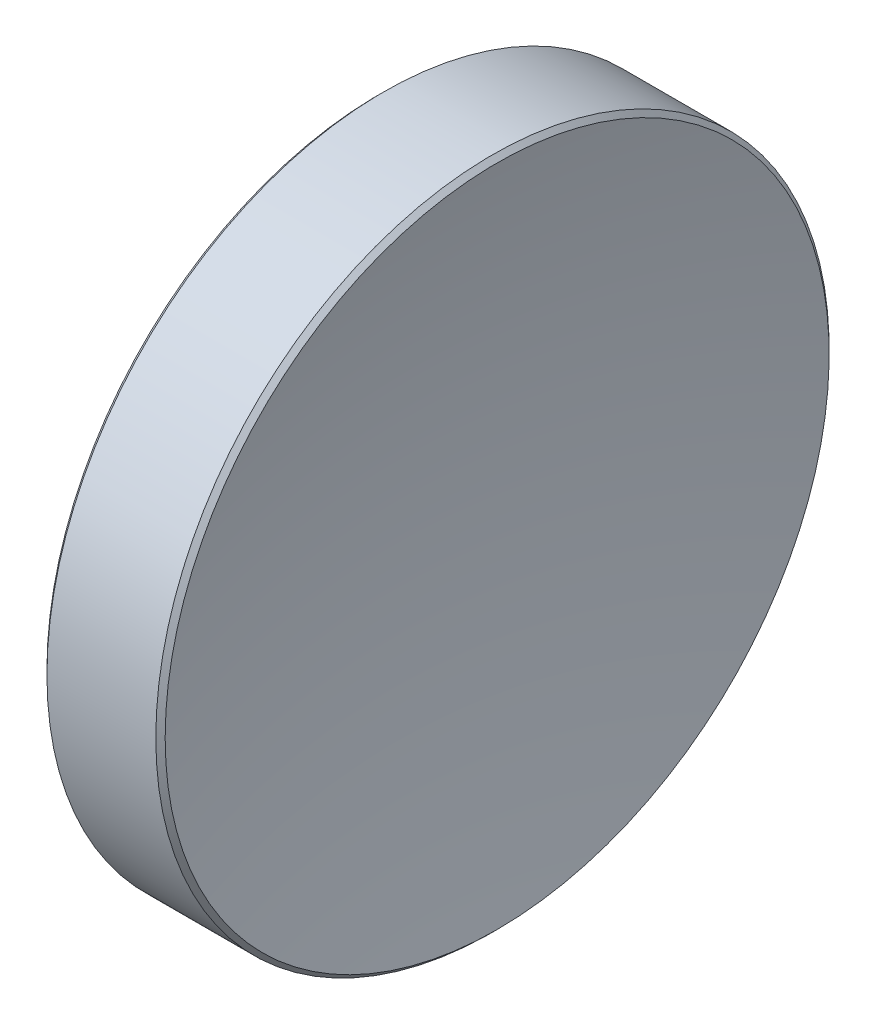
ISO-10303-21;
HEADER;
FILE_DESCRIPTION(('STEP AP214'),'2;1');
FILE_NAME('part.step','',(''),(''),'','','');
FILE_SCHEMA(('AUTOMOTIVE_DESIGN { 1 0 10303 214 1 1 1 1 }'));
ENDSEC;
DATA;
#1=APPLICATION_CONTEXT('core data for automotive mechanical design processes');
#2=APPLICATION_PROTOCOL_DEFINITION('international standard','automotive_design',2000,#1);
#3=PRODUCT_CONTEXT('',#1,'mechanical');
#4=PRODUCT('Part','Part','',(#3));
#5=PRODUCT_RELATED_PRODUCT_CATEGORY('part','',(#4));
#6=PRODUCT_DEFINITION_FORMATION('','',#4);
#7=PRODUCT_DEFINITION_CONTEXT('part definition',#1,'design');
#8=PRODUCT_DEFINITION('design','',#6,#7);
#9=PRODUCT_DEFINITION_SHAPE('','',#8);
#10=(LENGTH_UNIT() NAMED_UNIT(*) SI_UNIT(.MILLI.,.METRE.));
#11=(NAMED_UNIT(*) PLANE_ANGLE_UNIT() SI_UNIT($,.RADIAN.));
#12=(NAMED_UNIT(*) SI_UNIT($,.STERADIAN.) SOLID_ANGLE_UNIT());
#13=UNCERTAINTY_MEASURE_WITH_UNIT(LENGTH_MEASURE(1.E-05),#10,'distance_accuracy_value','');
#14=(GEOMETRIC_REPRESENTATION_CONTEXT(3) GLOBAL_UNCERTAINTY_ASSIGNED_CONTEXT((#13)) GLOBAL_UNIT_ASSIGNED_CONTEXT((#10,
#11,#12)) REPRESENTATION_CONTEXT('',''));
#15=CARTESIAN_POINT('',(0.,0.,0.));
#16=DIRECTION('',(0.,0.,1.));
#17=DIRECTION('',(1.,0.,0.));
#18=AXIS2_PLACEMENT_3D('',#15,#16,#17);
#19=CARTESIAN_POINT('',(148.246892112742,0.,0.965586100999808));
#20=DIRECTION('',(0.,-1.,0.));
#21=DIRECTION('',(0.,0.,1.));
#22=AXIS2_PLACEMENT_3D('',#19,#20,#21);
#23=CIRCLE('',#22,150.);
#24=TRIMMED_CURVE('',#23,(PARAMETER_VALUE(-1.57723361192686)),
(PARAMETER_VALUE(1.57723361192686)),.T.,.PARAMETER.);
#25=CARTESIAN_POINT('',(148.246892112742,0.,0.));
#26=DIRECTION('',(-1.,0.,0.));
#27=AXIS1_PLACEMENT('',#25,#26);
#28=SURFACE_OF_REVOLUTION('',#24,#27);
#29=CARTESIAN_POINT('',(-1.75,0.,0.));
#30=VERTEX_POINT('',#29);
#31=VERTEX_LOOP('',#30);
#32=FACE_BOUND('',#31,.T.);
#33=CARTESIAN_POINT('',(-1.30718179454939,0.,0.));
#34=DIRECTION('',(-1.,0.,0.));
#35=DIRECTION('',(0.,0.,1.));
#36=AXIS2_PLACEMENT_3D('',#33,#34,#35);
#37=CIRCLE('',#36,12.5232233047034);
#38=CARTESIAN_POINT('',(-1.30718179454939,0.,12.5232233047034));
#39=VERTEX_POINT('',#38);
#40=EDGE_CURVE('E10',#39,#39,#37,.T.);
#41=ORIENTED_EDGE('',*,*,#40,.T.);
#42=EDGE_LOOP('',(#41));
#43=FACE_BOUND('',#42,.T.);
#44=ADVANCED_FACE('F15',(#32,#43),#28,.T.);
#45=CARTESIAN_POINT('',(-1.13040509925275,0.,0.));
#46=DIRECTION('',(1.,0.,0.));
#47=DIRECTION('',(0.,0.,-1.));
#48=AXIS2_PLACEMENT_3D('',#45,#46,#47);
#49=CONICAL_SURFACE('',#48,12.7,0.785398163397446);
#50=ORIENTED_EDGE('',*,*,#40,.F.);
#51=EDGE_LOOP('',(#50));
#52=FACE_BOUND('',#51,.T.);
#53=CARTESIAN_POINT('',(-1.13040509925275,0.,0.));
#54=DIRECTION('',(-1.,0.,0.));
#55=DIRECTION('',(0.,0.,1.));
#56=AXIS2_PLACEMENT_3D('',#53,#54,#55);
#57=CIRCLE('',#56,12.7);
#58=CARTESIAN_POINT('',(-1.13040509925275,0.,12.7));
#59=VERTEX_POINT('',#58);
#60=EDGE_CURVE('E21',#59,#59,#57,.T.);
#61=ORIENTED_EDGE('',*,*,#60,.T.);
#62=EDGE_LOOP('',(#61));
#63=FACE_BOUND('',#62,.T.);
#64=ADVANCED_FACE('F26',(#52,#63),#49,.T.);
#65=CARTESIAN_POINT('',(-1.75,0.,0.));
#66=DIRECTION('',(-1.,0.,0.));
#67=DIRECTION('',(0.,0.,1.));
#68=AXIS2_PLACEMENT_3D('',#65,#66,#67);
#69=CYLINDRICAL_SURFACE('',#68,12.7);
#70=ORIENTED_EDGE('',*,*,#60,.F.);
#71=EDGE_LOOP('',(#70));
#72=FACE_BOUND('',#71,.T.);
#73=CARTESIAN_POINT('',(2.97604151015397,0.,0.));
#74=DIRECTION('',(-1.,0.,0.));
#75=DIRECTION('',(0.,0.,1.));
#76=AXIS2_PLACEMENT_3D('',#73,#74,#75);
#77=CIRCLE('',#76,12.7);
#78=CARTESIAN_POINT('',(2.97604151015397,0.,12.7));
#79=VERTEX_POINT('',#78);
#80=EDGE_CURVE('E35',#79,#79,#77,.T.);
#81=ORIENTED_EDGE('',*,*,#80,.T.);
#82=EDGE_LOOP('',(#81));
#83=FACE_BOUND('',#82,.T.);
#84=ADVANCED_FACE('F31',(#72,#83),#69,.T.);
#85=CARTESIAN_POINT('',(3.15281820545062,0.,0.));
#86=DIRECTION('',(-1.,0.,0.));
#87=DIRECTION('',(0.,0.,1.));
#88=AXIS2_PLACEMENT_3D('',#85,#86,#87);
#89=CONICAL_SURFACE('',#88,12.5232233047034,0.785398163397431);
#90=ORIENTED_EDGE('',*,*,#80,.F.);
#91=EDGE_LOOP('',(#90));
#92=FACE_BOUND('',#91,.T.);
#93=CARTESIAN_POINT('',(3.15281820545062,0.,0.));
#94=DIRECTION('',(-1.,0.,0.));
#95=DIRECTION('',(0.,0.,1.));
#96=AXIS2_PLACEMENT_3D('',#93,#94,#95);
#97=CIRCLE('',#96,12.5232233047034);
#98=CARTESIAN_POINT('',(3.15281820545062,0.,12.5232233047034));
#99=VERTEX_POINT('',#98);
#100=EDGE_CURVE('E37',#99,#99,#97,.T.);
#101=ORIENTED_EDGE('',*,*,#100,.T.);
#102=EDGE_LOOP('',(#101));
#103=FACE_BOUND('',#102,.T.);
#104=ADVANCED_FACE('F43',(#92,#103),#89,.T.);
#105=CARTESIAN_POINT('',(58.35,0.,0.));
#106=DIRECTION('',(-1.,0.,0.));
#107=DIRECTION('',(0.,-1.,0.));
#108=AXIS2_PLACEMENT_3D('',#105,#106,#107);
#109=SPHERICAL_SURFACE('',#108,56.6);
#110=ORIENTED_EDGE('',*,*,#100,.F.);
#111=EDGE_LOOP('',(#110));
#112=FACE_BOUND('',#111,.T.);
#113=ADVANCED_FACE('F45',(#112),#109,.F.);
#114=CLOSED_SHELL('',(#44,#64,#84,#104,#113));
#115=MANIFOLD_SOLID_BREP('B1',#114);
#116=ADVANCED_BREP_SHAPE_REPRESENTATION('',(#18,#115),#14);
#117=SHAPE_DEFINITION_REPRESENTATION(#9,#116);
ENDSEC;
END-ISO-10303-21;
